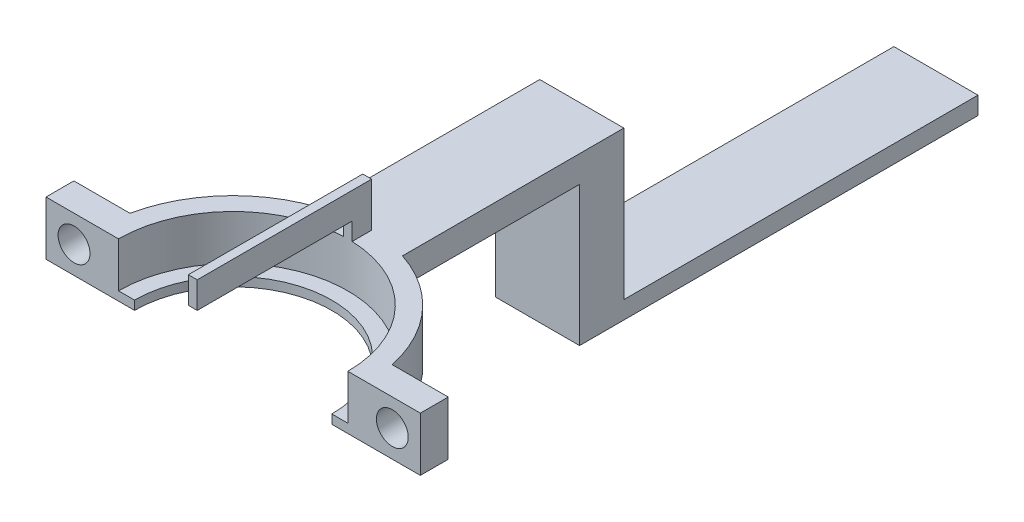
ISO-10303-21;
HEADER;
FILE_DESCRIPTION(('STEP AP214'),'2;1');
FILE_NAME('part.step','',(''),(''),'','','');
FILE_SCHEMA(('AUTOMOTIVE_DESIGN { 1 0 10303 214 1 1 1 1 }'));
ENDSEC;
DATA;
#1=APPLICATION_CONTEXT('core data for automotive mechanical design processes');
#2=APPLICATION_PROTOCOL_DEFINITION('international standard','automotive_design',2000,#1);
#3=PRODUCT_CONTEXT('',#1,'mechanical');
#4=PRODUCT('Part','Part','',(#3));
#5=PRODUCT_RELATED_PRODUCT_CATEGORY('part','',(#4));
#6=PRODUCT_DEFINITION_FORMATION('','',#4);
#7=PRODUCT_DEFINITION_CONTEXT('part definition',#1,'design');
#8=PRODUCT_DEFINITION('design','',#6,#7);
#9=PRODUCT_DEFINITION_SHAPE('','',#8);
#10=(LENGTH_UNIT() NAMED_UNIT(*) SI_UNIT(.MILLI.,.METRE.));
#11=(NAMED_UNIT(*) PLANE_ANGLE_UNIT() SI_UNIT($,.RADIAN.));
#12=(NAMED_UNIT(*) SI_UNIT($,.STERADIAN.) SOLID_ANGLE_UNIT());
#13=UNCERTAINTY_MEASURE_WITH_UNIT(LENGTH_MEASURE(1.E-05),#10,'distance_accuracy_value','');
#14=(GEOMETRIC_REPRESENTATION_CONTEXT(3) GLOBAL_UNCERTAINTY_ASSIGNED_CONTEXT((#13)) GLOBAL_UNIT_ASSIGNED_CONTEXT((#10,
#11,#12)) REPRESENTATION_CONTEXT('',''));
#15=CARTESIAN_POINT('',(0.,0.,0.));
#16=DIRECTION('',(0.,0.,1.));
#17=DIRECTION('',(1.,0.,0.));
#18=AXIS2_PLACEMENT_3D('',#15,#16,#17);
#19=CARTESIAN_POINT('',(-49.7442644411717,8.73372881640382,0.));
#20=DIRECTION('',(0.,1.,0.));
#21=DIRECTION('',(0.,0.,1.));
#22=AXIS2_PLACEMENT_3D('',#19,#20,#21);
#23=PLANE('',#22);
#24=DIRECTION('',(-1.,0.,0.));
#25=VECTOR('',#24,1.);
#26=CARTESIAN_POINT('',(-54.4942644411717,8.73372881640382,-34.3758545480795));
#27=LINE('',#26,#25);
#28=CARTESIAN_POINT('',(-44.9942644411717,8.73372881640382,-34.3758545480795));
#29=VERTEX_POINT('',#28);
#30=CARTESIAN_POINT('',(-54.4942644411717,8.73372881640382,-34.3758545480795));
#31=VERTEX_POINT('',#30);
#32=EDGE_CURVE('E279',#29,#31,#27,.T.);
#33=ORIENTED_EDGE('',*,*,#32,.F.);
#34=DIRECTION('',(0.,0.,-1.));
#35=VECTOR('',#34,1.);
#36=CARTESIAN_POINT('',(-44.9942644411717,8.73372881640382,-39.3758545480795));
#37=LINE('',#36,#35);
#38=CARTESIAN_POINT('',(-44.9942644411717,8.73372881640382,-14.3758545480795));
#39=VERTEX_POINT('',#38);
#40=EDGE_CURVE('E304',#39,#29,#37,.T.);
#41=ORIENTED_EDGE('',*,*,#40,.F.);
#42=CARTESIAN_POINT('',(-49.7442644411717,8.73372881640382,0.));
#43=DIRECTION('',(0.,-1.,0.));
#44=DIRECTION('',(0.,0.,1.));
#45=AXIS2_PLACEMENT_3D('',#42,#43,#44);
#46=CIRCLE('',#45,15.1402673023807);
#47=CARTESIAN_POINT('',(-54.4942644411717,8.73372881640382,-14.3758545480795));
#48=VERTEX_POINT('',#47);
#49=EDGE_CURVE('E301',#48,#39,#46,.T.);
#50=ORIENTED_EDGE('',*,*,#49,.F.);
#51=DIRECTION('',(0.,0.,1.));
#52=VECTOR('',#51,1.);
#53=CARTESIAN_POINT('',(-54.4942644411717,8.73372881640382,-14.3758545480795));
#54=LINE('',#53,#52);
#55=EDGE_CURVE('E309',#31,#48,#54,.T.);
#56=ORIENTED_EDGE('',*,*,#55,.F.);
#57=EDGE_LOOP('',(#33,#41,#50,#56));
#58=FACE_BOUND('',#57,.T.);
#59=ADVANCED_FACE('F45',(#58),#23,.F.);
#60=CARTESIAN_POINT('',(-49.7442644411717,0.,0.));
#61=DIRECTION('',(0.,-1.,0.));
#62=DIRECTION('',(0.,0.,-1.));
#63=AXIS2_PLACEMENT_3D('',#60,#61,#62);
#64=CYLINDRICAL_SURFACE('',#63,15.1402673023807);
#65=CARTESIAN_POINT('',(-49.7442644411717,5.63979924945554,0.));
#66=DIRECTION('',(0.,-1.,0.));
#67=DIRECTION('',(0.,0.,-1.));
#68=AXIS2_PLACEMENT_3D('',#65,#66,#67);
#69=CIRCLE('',#68,15.1402673023807);
#70=CARTESIAN_POINT('',(-64.5532209873817,5.63979924945554,-3.15));
#71=VERTEX_POINT('',#70);
#72=CARTESIAN_POINT('',(-34.9353078949616,5.63979924945554,-3.15000000000001));
#73=VERTEX_POINT('',#72);
#74=EDGE_CURVE('E412',#71,#73,#69,.T.);
#75=ORIENTED_EDGE('',*,*,#74,.F.);
#76=DIRECTION('',(0.,1.,0.));
#77=VECTOR('',#76,1.);
#78=CARTESIAN_POINT('',(-64.5532209873817,-3.29191368207121,-3.15));
#79=LINE('',#78,#77);
#80=CARTESIAN_POINT('',(-64.5532209873817,11.7337288164038,-3.15));
#81=VERTEX_POINT('',#80);
#82=EDGE_CURVE('E425',#71,#81,#79,.T.);
#83=ORIENTED_EDGE('',*,*,#82,.T.);
#84=CARTESIAN_POINT('',(-49.7442644411717,11.7337288164038,0.));
#85=DIRECTION('',(0.,-1.,0.));
#86=DIRECTION('',(0.,0.,-1.));
#87=AXIS2_PLACEMENT_3D('',#84,#85,#86);
#88=CIRCLE('',#87,15.1402673023807);
#89=CARTESIAN_POINT('',(-54.4942644411717,11.7337288164038,-14.3758545480795));
#90=VERTEX_POINT('',#89);
#91=EDGE_CURVE('E55',#81,#90,#88,.T.);
#92=ORIENTED_EDGE('',*,*,#91,.T.);
#93=DIRECTION('',(0.,1.,0.));
#94=VECTOR('',#93,1.);
#95=CARTESIAN_POINT('',(-54.4942644411717,8.73372881640382,-14.3758545480795));
#96=LINE('',#95,#94);
#97=EDGE_CURVE('E327',#48,#90,#96,.T.);
#98=ORIENTED_EDGE('',*,*,#97,.F.);
#99=ORIENTED_EDGE('',*,*,#49,.T.);
#100=DIRECTION('',(0.,1.,0.));
#101=VECTOR('',#100,1.);
#102=CARTESIAN_POINT('',(-44.9942644411717,8.73372881640382,-14.3758545480795));
#103=LINE('',#102,#101);
#104=CARTESIAN_POINT('',(-44.9942644411717,11.7337288164038,-14.3758545480795));
#105=VERTEX_POINT('',#104);
#106=EDGE_CURVE('E312',#39,#105,#103,.T.);
#107=ORIENTED_EDGE('',*,*,#106,.T.);
#108=CARTESIAN_POINT('',(-34.9353078949616,11.7337288164038,-3.15000000000001));
#109=VERTEX_POINT('',#108);
#110=EDGE_CURVE('E11',#105,#109,#88,.T.);
#111=ORIENTED_EDGE('',*,*,#110,.T.);
#112=DIRECTION('',(0.,1.,0.));
#113=VECTOR('',#112,1.);
#114=CARTESIAN_POINT('',(-34.9353078949616,-3.29191368207121,-3.15000000000001));
#115=LINE('',#114,#113);
#116=EDGE_CURVE('E251',#73,#109,#115,.T.);
#117=ORIENTED_EDGE('',*,*,#116,.F.);
#118=EDGE_LOOP('',(#75,#83,#92,#98,#99,#107,#111,#117));
#119=FACE_BOUND('',#118,.T.);
#120=ADVANCED_FACE('F423',(#119),#64,.T.);
#121=CARTESIAN_POINT('',(-49.7442644411717,0.,0.));
#122=DIRECTION('',(0.,-1.,0.));
#123=DIRECTION('',(0.,0.,-1.));
#124=AXIS2_PLACEMENT_3D('',#121,#122,#123);
#125=CYLINDRICAL_SURFACE('',#124,12.95);
#126=CARTESIAN_POINT('',(-49.7442644411717,6.65067910325642,0.));
#127=DIRECTION('',(0.,-1.,0.));
#128=DIRECTION('',(0.,0.,-1.));
#129=AXIS2_PLACEMENT_3D('',#126,#127,#128);
#130=CIRCLE('',#129,12.95);
#131=CARTESIAN_POINT('',(-62.6942644411717,6.65067910325642,0.));
#132=VERTEX_POINT('',#131);
#133=CARTESIAN_POINT('',(-36.7942644411717,6.65067910325642,0.));
#134=VERTEX_POINT('',#133);
#135=EDGE_CURVE('E400',#132,#134,#130,.T.);
#136=ORIENTED_EDGE('',*,*,#135,.T.);
#137=DIRECTION('',(0.,-1.,0.));
#138=VECTOR('',#137,1.);
#139=CARTESIAN_POINT('',(-36.7942644411717,0.,0.));
#140=LINE('',#139,#138);
#141=CARTESIAN_POINT('',(-36.7942644411717,11.7337288164038,0.));
#142=VERTEX_POINT('',#141);
#143=EDGE_CURVE('E481',#134,#142,#140,.F.);
#144=ORIENTED_EDGE('',*,*,#143,.T.);
#145=CARTESIAN_POINT('',(-49.7442644411717,11.7337288164038,0.));
#146=DIRECTION('',(0.,-1.,0.));
#147=DIRECTION('',(0.,0.,-1.));
#148=AXIS2_PLACEMENT_3D('',#145,#146,#147);
#149=CIRCLE('',#148,12.95);
#150=CARTESIAN_POINT('',(-49.2442644411717,11.7337288164038,-12.94034389033));
#151=VERTEX_POINT('',#150);
#152=EDGE_CURVE('E225',#151,#142,#149,.T.);
#153=ORIENTED_EDGE('',*,*,#152,.F.);
#154=DIRECTION('',(0.,-1.,0.));
#155=VECTOR('',#154,1.);
#156=CARTESIAN_POINT('',(-49.2442644411717,16.7337288164038,-12.94034389033));
#157=LINE('',#156,#155);
#158=CARTESIAN_POINT('',(-49.2442644411717,13.7337288164038,-12.94034389033));
#159=VERTEX_POINT('',#158);
#160=EDGE_CURVE('E386',#159,#151,#157,.T.);
#161=ORIENTED_EDGE('',*,*,#160,.F.);
#162=CARTESIAN_POINT('',(-49.7442644411717,13.7337288164038,0.));
#163=DIRECTION('',(0.,1.,0.));
#164=DIRECTION('',(0.,0.,1.));
#165=AXIS2_PLACEMENT_3D('',#162,#163,#164);
#166=CIRCLE('',#165,12.95);
#167=CARTESIAN_POINT('',(-50.2442644411717,13.7337288164038,-12.94034389033));
#168=VERTEX_POINT('',#167);
#169=EDGE_CURVE('E359',#168,#159,#166,.F.);
#170=ORIENTED_EDGE('',*,*,#169,.F.);
#171=DIRECTION('',(0.,-1.,0.));
#172=VECTOR('',#171,1.);
#173=CARTESIAN_POINT('',(-50.2442644411717,16.7337288164038,-12.94034389033));
#174=LINE('',#173,#172);
#175=CARTESIAN_POINT('',(-50.2442644411717,11.7337288164038,-12.94034389033));
#176=VERTEX_POINT('',#175);
#177=EDGE_CURVE('E389',#168,#176,#174,.T.);
#178=ORIENTED_EDGE('',*,*,#177,.T.);
#179=CARTESIAN_POINT('',(-62.6942644411717,11.7337288164038,0.));
#180=VERTEX_POINT('',#179);
#181=EDGE_CURVE('E397',#180,#176,#149,.T.);
#182=ORIENTED_EDGE('',*,*,#181,.F.);
#183=DIRECTION('',(0.,-1.,0.));
#184=VECTOR('',#183,1.);
#185=CARTESIAN_POINT('',(-62.6942644411717,0.,0.));
#186=LINE('',#185,#184);
#187=EDGE_CURVE('E215',#180,#132,#186,.T.);
#188=ORIENTED_EDGE('',*,*,#187,.T.);
#189=EDGE_LOOP('',(#136,#144,#153,#161,#170,#178,#182,#188));
#190=FACE_BOUND('',#189,.T.);
#191=ADVANCED_FACE('F524',(#190),#125,.F.);
#192=CARTESIAN_POINT('',(-62.6942644411717,11.7337288164038,0.));
#193=DIRECTION('',(0.,-1.,0.));
#194=DIRECTION('',(0.,0.,-1.));
#195=AXIS2_PLACEMENT_3D('',#192,#193,#194);
#196=PLANE('',#195);
#197=DIRECTION('',(0.,0.,1.));
#198=VECTOR('',#197,1.);
#199=CARTESIAN_POINT('',(-70.8845317435524,11.7337288164038,-3.15));
#200=LINE('',#199,#198);
#201=CARTESIAN_POINT('',(-70.8845317435524,11.7337288164038,-3.15));
#202=VERTEX_POINT('',#201);
#203=CARTESIAN_POINT('',(-70.8845317435524,11.7337288164038,0.));
#204=VERTEX_POINT('',#203);
#205=EDGE_CURVE('E239',#202,#204,#200,.T.);
#206=ORIENTED_EDGE('',*,*,#205,.T.);
#207=DIRECTION('',(-1.,0.,0.));
#208=VECTOR('',#207,1.);
#209=CARTESIAN_POINT('',(-23.4421170692061,11.7337288164038,0.));
#210=LINE('',#209,#208);
#211=EDGE_CURVE('E70',#180,#204,#210,.T.);
#212=ORIENTED_EDGE('',*,*,#211,.F.);
#213=ORIENTED_EDGE('',*,*,#181,.T.);
#214=DIRECTION('',(0.,0.,1.));
#215=VECTOR('',#214,1.);
#216=CARTESIAN_POINT('',(-50.2442644411717,11.7337288164038,-15.1320089210765));
#217=LINE('',#216,#215);
#218=CARTESIAN_POINT('',(-50.2442644411717,11.7337288164038,-15.1320089210765));
#219=VERTEX_POINT('',#218);
#220=EDGE_CURVE('E365',#219,#176,#217,.T.);
#221=ORIENTED_EDGE('',*,*,#220,.F.);
#222=CARTESIAN_POINT('',(-49.7442644411717,11.7337288164038,0.));
#223=DIRECTION('',(0.,-1.,0.));
#224=DIRECTION('',(0.,0.,1.));
#225=AXIS2_PLACEMENT_3D('',#222,#223,#224);
#226=CIRCLE('',#225,15.1402673023807);
#227=CARTESIAN_POINT('',(-49.2442644411717,11.7337288164038,-15.1320089210765));
#228=VERTEX_POINT('',#227);
#229=EDGE_CURVE('E305',#219,#228,#226,.T.);
#230=ORIENTED_EDGE('',*,*,#229,.T.);
#231=DIRECTION('',(0.,0.,-1.));
#232=VECTOR('',#231,1.);
#233=CARTESIAN_POINT('',(-49.2442644411717,11.7337288164038,-15.1320089210765));
#234=LINE('',#233,#232);
#235=EDGE_CURVE('E371',#151,#228,#234,.T.);
#236=ORIENTED_EDGE('',*,*,#235,.F.);
#237=ORIENTED_EDGE('',*,*,#152,.T.);
#238=CARTESIAN_POINT('',(-28.603997138791,11.7337288164038,0.));
#239=VERTEX_POINT('',#238);
#240=EDGE_CURVE('E208',#239,#142,#210,.T.);
#241=ORIENTED_EDGE('',*,*,#240,.F.);
#242=DIRECTION('',(0.,0.,-1.));
#243=VECTOR('',#242,1.);
#244=CARTESIAN_POINT('',(-28.603997138791,11.7337288164038,3.15000000000001));
#245=LINE('',#244,#243);
#246=CARTESIAN_POINT('',(-28.603997138791,11.7337288164038,-3.15000000000001));
#247=VERTEX_POINT('',#246);
#248=EDGE_CURVE('E221',#239,#247,#245,.T.);
#249=ORIENTED_EDGE('',*,*,#248,.T.);
#250=DIRECTION('',(-1.,0.,0.));
#251=VECTOR('',#250,1.);
#252=CARTESIAN_POINT('',(-28.603997138791,11.7337288164038,-3.15000000000001));
#253=LINE('',#252,#251);
#254=EDGE_CURVE('E234',#247,#109,#253,.T.);
#255=ORIENTED_EDGE('',*,*,#254,.T.);
#256=ORIENTED_EDGE('',*,*,#110,.F.);
#257=DIRECTION('',(0.,0.,-1.));
#258=VECTOR('',#257,1.);
#259=CARTESIAN_POINT('',(-44.9942644411717,11.7337288164038,-39.3758545480795));
#260=LINE('',#259,#258);
#261=CARTESIAN_POINT('',(-44.9942644411717,11.7337288164038,-39.3758545480795));
#262=VERTEX_POINT('',#261);
#263=EDGE_CURVE('E300',#105,#262,#260,.T.);
#264=ORIENTED_EDGE('',*,*,#263,.T.);
#265=DIRECTION('',(-1.,0.,0.));
#266=VECTOR('',#265,1.);
#267=CARTESIAN_POINT('',(-54.4942644411717,11.7337288164038,-39.3758545480795));
#268=LINE('',#267,#266);
#269=CARTESIAN_POINT('',(-54.4942644411717,11.7337288164038,-39.3758545480795));
#270=VERTEX_POINT('',#269);
#271=EDGE_CURVE('E316',#262,#270,#268,.T.);
#272=ORIENTED_EDGE('',*,*,#271,.T.);
#273=DIRECTION('',(0.,0.,1.));
#274=VECTOR('',#273,1.);
#275=CARTESIAN_POINT('',(-54.4942644411717,11.7337288164038,-14.3758545480795));
#276=LINE('',#275,#274);
#277=EDGE_CURVE('E320',#270,#90,#276,.T.);
#278=ORIENTED_EDGE('',*,*,#277,.T.);
#279=ORIENTED_EDGE('',*,*,#91,.F.);
#280=DIRECTION('',(-1.,0.,0.));
#281=VECTOR('',#280,1.);
#282=CARTESIAN_POINT('',(-64.5532209873817,11.7337288164038,-3.15));
#283=LINE('',#282,#281);
#284=EDGE_CURVE('E233',#81,#202,#283,.T.);
#285=ORIENTED_EDGE('',*,*,#284,.T.);
#286=EDGE_LOOP('',(#206,#212,#213,#221,#230,#236,#237,#241,#249,#255,#256,#264,#272,#278,#279,#285));
#287=FACE_BOUND('',#286,.T.);
#288=ADVANCED_FACE('F47',(#287),#196,.F.);
#289=DIRECTION('',(0.,-1.,0.));
#290=VECTOR('',#289,1.);
#291=CARTESIAN_POINT('',(-49.2442644411717,16.7337288164038,-15.1320089210765));
#292=LINE('',#291,#290);
#293=CARTESIAN_POINT('',(-49.2442644411717,16.7337288164038,-15.1320089210765));
#294=VERTEX_POINT('',#293);
#295=EDGE_CURVE('E377',#294,#228,#292,.T.);
#296=ORIENTED_EDGE('',*,*,#295,.T.);
#297=ORIENTED_EDGE('',*,*,#229,.F.);
#298=DIRECTION('',(0.,-1.,0.));
#299=VECTOR('',#298,1.);
#300=CARTESIAN_POINT('',(-50.2442644411717,16.7337288164038,-15.1320089210765));
#301=LINE('',#300,#299);
#302=CARTESIAN_POINT('',(-50.2442644411717,16.7337288164038,-15.1320089210765));
#303=VERTEX_POINT('',#302);
#304=EDGE_CURVE('E393',#303,#219,#301,.T.);
#305=ORIENTED_EDGE('',*,*,#304,.F.);
#306=CARTESIAN_POINT('',(-49.7442644411717,16.7337288164038,0.));
#307=DIRECTION('',(0.,1.,0.));
#308=DIRECTION('',(0.,0.,1.));
#309=AXIS2_PLACEMENT_3D('',#306,#307,#308);
#310=CIRCLE('',#309,15.1402673023807);
#311=EDGE_CURVE('E366',#294,#303,#310,.T.);
#312=ORIENTED_EDGE('',*,*,#311,.F.);
#313=EDGE_LOOP('',(#296,#297,#305,#312));
#314=FACE_BOUND('',#313,.T.);
#315=ADVANCED_FACE('F545',(#314),#64,.T.);
#316=CARTESIAN_POINT('',(-64.8845317435524,5.63979924945554,0.));
#317=DIRECTION('',(0.,1.,0.));
#318=DIRECTION('',(0.,0.,1.));
#319=AXIS2_PLACEMENT_3D('',#316,#317,#318);
#320=PLANE('',#319);
#321=DIRECTION('',(0.,0.,1.));
#322=VECTOR('',#321,1.);
#323=CARTESIAN_POINT('',(-28.603997138791,5.63979924945554,3.15000000000001));
#324=LINE('',#323,#322);
#325=CARTESIAN_POINT('',(-28.603997138791,5.63979924945554,-3.15000000000001));
#326=VERTEX_POINT('',#325);
#327=CARTESIAN_POINT('',(-28.603997138791,5.63979924945554,0.));
#328=VERTEX_POINT('',#327);
#329=EDGE_CURVE('E247',#326,#328,#324,.T.);
#330=ORIENTED_EDGE('',*,*,#329,.T.);
#331=DIRECTION('',(-1.,0.,0.));
#332=VECTOR('',#331,1.);
#333=CARTESIAN_POINT('',(-64.8845317435524,5.63979924945554,0.));
#334=LINE('',#333,#332);
#335=CARTESIAN_POINT('',(-38.603997138791,5.63979924945554,0.));
#336=VERTEX_POINT('',#335);
#337=EDGE_CURVE('E62',#328,#336,#334,.T.);
#338=ORIENTED_EDGE('',*,*,#337,.T.);
#339=CARTESIAN_POINT('',(-49.7442644411717,5.63979924945554,0.));
#340=DIRECTION('',(0.,-1.,0.));
#341=DIRECTION('',(0.,0.,-1.));
#342=AXIS2_PLACEMENT_3D('',#339,#340,#341);
#343=CIRCLE('',#342,11.1402673023807);
#344=CARTESIAN_POINT('',(-60.8845317435524,5.63979924945554,0.));
#345=VERTEX_POINT('',#344);
#346=EDGE_CURVE('E408',#345,#336,#343,.T.);
#347=ORIENTED_EDGE('',*,*,#346,.F.);
#348=CARTESIAN_POINT('',(-70.8845317435524,5.63979924945554,0.));
#349=VERTEX_POINT('',#348);
#350=EDGE_CURVE('E503',#345,#349,#334,.T.);
#351=ORIENTED_EDGE('',*,*,#350,.T.);
#352=DIRECTION('',(0.,0.,-1.));
#353=VECTOR('',#352,1.);
#354=CARTESIAN_POINT('',(-70.8845317435524,5.63979924945554,-3.15));
#355=LINE('',#354,#353);
#356=CARTESIAN_POINT('',(-70.8845317435524,5.63979924945554,-3.15));
#357=VERTEX_POINT('',#356);
#358=EDGE_CURVE('E467',#349,#357,#355,.T.);
#359=ORIENTED_EDGE('',*,*,#358,.T.);
#360=DIRECTION('',(1.,0.,0.));
#361=VECTOR('',#360,1.);
#362=CARTESIAN_POINT('',(-64.5532209873817,5.63979924945554,-3.15));
#363=LINE('',#362,#361);
#364=EDGE_CURVE('E271',#357,#71,#363,.T.);
#365=ORIENTED_EDGE('',*,*,#364,.T.);
#366=ORIENTED_EDGE('',*,*,#74,.T.);
#367=DIRECTION('',(1.,0.,0.));
#368=VECTOR('',#367,1.);
#369=CARTESIAN_POINT('',(-28.603997138791,5.63979924945554,-3.15000000000001));
#370=LINE('',#369,#368);
#371=EDGE_CURVE('E244',#73,#326,#370,.T.);
#372=ORIENTED_EDGE('',*,*,#371,.T.);
#373=EDGE_LOOP('',(#330,#338,#347,#351,#359,#365,#366,#372));
#374=FACE_BOUND('',#373,.T.);
#375=ADVANCED_FACE('F534',(#374),#320,.F.);
#376=CARTESIAN_POINT('',(-49.7442644411717,0.,0.));
#377=DIRECTION('',(0.,-1.,0.));
#378=DIRECTION('',(0.,0.,-1.));
#379=AXIS2_PLACEMENT_3D('',#376,#377,#378);
#380=CYLINDRICAL_SURFACE('',#379,11.1402673023807);
#381=ORIENTED_EDGE('',*,*,#346,.T.);
#382=DIRECTION('',(0.,-1.,0.));
#383=VECTOR('',#382,1.);
#384=CARTESIAN_POINT('',(-38.603997138791,0.,0.));
#385=LINE('',#384,#383);
#386=CARTESIAN_POINT('',(-38.603997138791,6.65067910325642,0.));
#387=VERTEX_POINT('',#386);
#388=EDGE_CURVE('E488',#336,#387,#385,.F.);
#389=ORIENTED_EDGE('',*,*,#388,.T.);
#390=CARTESIAN_POINT('',(-49.7442644411717,6.65067910325642,0.));
#391=DIRECTION('',(0.,-1.,0.));
#392=DIRECTION('',(0.,0.,-1.));
#393=AXIS2_PLACEMENT_3D('',#390,#391,#392);
#394=CIRCLE('',#393,11.1402673023807);
#395=CARTESIAN_POINT('',(-60.8845317435524,6.65067910325642,0.));
#396=VERTEX_POINT('',#395);
#397=EDGE_CURVE('E404',#396,#387,#394,.T.);
#398=ORIENTED_EDGE('',*,*,#397,.F.);
#399=DIRECTION('',(0.,-1.,0.));
#400=VECTOR('',#399,1.);
#401=CARTESIAN_POINT('',(-60.8845317435524,0.,0.));
#402=LINE('',#401,#400);
#403=EDGE_CURVE('E499',#396,#345,#402,.T.);
#404=ORIENTED_EDGE('',*,*,#403,.T.);
#405=EDGE_LOOP('',(#381,#389,#398,#404));
#406=FACE_BOUND('',#405,.T.);
#407=ADVANCED_FACE('F536',(#406),#380,.F.);
#408=CARTESIAN_POINT('',(-60.8845317435524,6.65067910325642,0.));
#409=DIRECTION('',(0.,-1.,0.));
#410=DIRECTION('',(0.,0.,-1.));
#411=AXIS2_PLACEMENT_3D('',#408,#409,#410);
#412=PLANE('',#411);
#413=ORIENTED_EDGE('',*,*,#135,.F.);
#414=DIRECTION('',(1.,0.,0.));
#415=VECTOR('',#414,1.);
#416=CARTESIAN_POINT('',(-60.8845317435524,6.65067910325642,0.));
#417=LINE('',#416,#415);
#418=EDGE_CURVE('E495',#132,#396,#417,.T.);
#419=ORIENTED_EDGE('',*,*,#418,.T.);
#420=ORIENTED_EDGE('',*,*,#397,.T.);
#421=EDGE_CURVE('E487',#387,#134,#417,.T.);
#422=ORIENTED_EDGE('',*,*,#421,.T.);
#423=EDGE_LOOP('',(#413,#419,#420,#422));
#424=FACE_BOUND('',#423,.T.);
#425=ADVANCED_FACE('F521',(#424),#412,.F.);
#426=CARTESIAN_POINT('',(-50.2442644411717,16.7337288164038,-15.1320089210765));
#427=DIRECTION('',(1.,0.,0.));
#428=DIRECTION('',(0.,0.,-1.));
#429=AXIS2_PLACEMENT_3D('',#426,#427,#428);
#430=PLANE('',#429);
#431=ORIENTED_EDGE('',*,*,#304,.T.);
#432=ORIENTED_EDGE('',*,*,#220,.T.);
#433=ORIENTED_EDGE('',*,*,#177,.F.);
#434=DIRECTION('',(0.,0.,1.));
#435=VECTOR('',#434,1.);
#436=CARTESIAN_POINT('',(-50.2442644411717,13.7337288164038,-15.1320089210765));
#437=LINE('',#436,#435);
#438=CARTESIAN_POINT('',(-50.2442644411717,13.7337288164038,4.55965610967004));
#439=VERTEX_POINT('',#438);
#440=EDGE_CURVE('E340',#168,#439,#437,.T.);
#441=ORIENTED_EDGE('',*,*,#440,.T.);
#442=DIRECTION('',(0.,1.,0.));
#443=VECTOR('',#442,1.);
#444=CARTESIAN_POINT('',(-50.2442644411717,13.7337288164038,4.55965610967004));
#445=LINE('',#444,#443);
#446=CARTESIAN_POINT('',(-50.2442644411717,16.7337288164038,4.55965610967004));
#447=VERTEX_POINT('',#446);
#448=EDGE_CURVE('E351',#439,#447,#445,.T.);
#449=ORIENTED_EDGE('',*,*,#448,.T.);
#450=DIRECTION('',(0.,0.,1.));
#451=VECTOR('',#450,1.);
#452=CARTESIAN_POINT('',(-50.2442644411717,16.7337288164038,-15.1320089210765));
#453=LINE('',#452,#451);
#454=EDGE_CURVE('E370',#303,#447,#453,.T.);
#455=ORIENTED_EDGE('',*,*,#454,.F.);
#456=EDGE_LOOP('',(#431,#432,#433,#441,#449,#455));
#457=FACE_BOUND('',#456,.T.);
#458=ADVANCED_FACE('F543',(#457),#430,.F.);
#459=CARTESIAN_POINT('',(-49.2442644411717,16.7337288164038,-15.1320089210765));
#460=DIRECTION('',(-1.,0.,0.));
#461=DIRECTION('',(0.,0.,1.));
#462=AXIS2_PLACEMENT_3D('',#459,#460,#461);
#463=PLANE('',#462);
#464=DIRECTION('',(0.,0.,-1.));
#465=VECTOR('',#464,1.);
#466=CARTESIAN_POINT('',(-49.2442644411717,16.7337288164038,-15.1320089210765));
#467=LINE('',#466,#465);
#468=CARTESIAN_POINT('',(-49.2442644411717,16.7337288164038,4.55965610967004));
#469=VERTEX_POINT('',#468);
#470=EDGE_CURVE('E374',#469,#294,#467,.T.);
#471=ORIENTED_EDGE('',*,*,#470,.F.);
#472=DIRECTION('',(0.,1.,0.));
#473=VECTOR('',#472,1.);
#474=CARTESIAN_POINT('',(-49.2442644411717,13.7337288164038,4.55965610967004));
#475=LINE('',#474,#473);
#476=CARTESIAN_POINT('',(-49.2442644411717,13.7337288164038,4.55965610967004));
#477=VERTEX_POINT('',#476);
#478=EDGE_CURVE('E355',#477,#469,#475,.T.);
#479=ORIENTED_EDGE('',*,*,#478,.F.);
#480=DIRECTION('',(0.,0.,-1.));
#481=VECTOR('',#480,1.);
#482=CARTESIAN_POINT('',(-49.2442644411717,13.7337288164038,4.55965610967004));
#483=LINE('',#482,#481);
#484=EDGE_CURVE('E347',#477,#159,#483,.T.);
#485=ORIENTED_EDGE('',*,*,#484,.T.);
#486=ORIENTED_EDGE('',*,*,#160,.T.);
#487=ORIENTED_EDGE('',*,*,#235,.T.);
#488=ORIENTED_EDGE('',*,*,#295,.F.);
#489=EDGE_LOOP('',(#471,#479,#485,#486,#487,#488));
#490=FACE_BOUND('',#489,.T.);
#491=ADVANCED_FACE('F574',(#490),#463,.F.);
#492=CARTESIAN_POINT('',(-49.7442644411717,16.7337288164038,0.));
#493=DIRECTION('',(0.,1.,0.));
#494=DIRECTION('',(0.,0.,1.));
#495=AXIS2_PLACEMENT_3D('',#492,#493,#494);
#496=PLANE('',#495);
#497=ORIENTED_EDGE('',*,*,#311,.T.);
#498=ORIENTED_EDGE('',*,*,#454,.T.);
#499=DIRECTION('',(1.,0.,0.));
#500=VECTOR('',#499,1.);
#501=CARTESIAN_POINT('',(-50.2442644411717,16.7337288164038,4.55965610967004));
#502=LINE('',#501,#500);
#503=EDGE_CURVE('E331',#447,#469,#502,.T.);
#504=ORIENTED_EDGE('',*,*,#503,.T.);
#505=ORIENTED_EDGE('',*,*,#470,.T.);
#506=EDGE_LOOP('',(#497,#498,#504,#505));
#507=FACE_BOUND('',#506,.T.);
#508=ADVANCED_FACE('F567',(#507),#496,.T.);
#509=CARTESIAN_POINT('',(-49.7442644411717,13.7337288164038,0.));
#510=DIRECTION('',(0.,1.,0.));
#511=DIRECTION('',(0.,0.,1.));
#512=AXIS2_PLACEMENT_3D('',#509,#510,#511);
#513=PLANE('',#512);
#514=ORIENTED_EDGE('',*,*,#440,.F.);
#515=ORIENTED_EDGE('',*,*,#169,.T.);
#516=ORIENTED_EDGE('',*,*,#484,.F.);
#517=DIRECTION('',(1.,0.,0.));
#518=VECTOR('',#517,1.);
#519=CARTESIAN_POINT('',(-50.2442644411717,13.7337288164038,4.55965610967004));
#520=LINE('',#519,#518);
#521=EDGE_CURVE('E343',#439,#477,#520,.T.);
#522=ORIENTED_EDGE('',*,*,#521,.F.);
#523=EDGE_LOOP('',(#514,#515,#516,#522));
#524=FACE_BOUND('',#523,.T.);
#525=ADVANCED_FACE('F564',(#524),#513,.F.);
#526=CARTESIAN_POINT('',(-50.2442644411717,13.7337288164038,4.55965610967004));
#527=DIRECTION('',(0.,0.,1.));
#528=DIRECTION('',(1.,0.,0.));
#529=AXIS2_PLACEMENT_3D('',#526,#527,#528);
#530=PLANE('',#529);
#531=ORIENTED_EDGE('',*,*,#503,.F.);
#532=ORIENTED_EDGE('',*,*,#448,.F.);
#533=ORIENTED_EDGE('',*,*,#521,.T.);
#534=ORIENTED_EDGE('',*,*,#478,.T.);
#535=EDGE_LOOP('',(#531,#532,#533,#534));
#536=FACE_BOUND('',#535,.T.);
#537=ADVANCED_FACE('F559',(#536),#530,.T.);
#538=CARTESIAN_POINT('',(-54.4942644411717,8.73372881640382,-14.3758545480795));
#539=DIRECTION('',(-1.,0.,0.));
#540=DIRECTION('',(0.,0.,1.));
#541=AXIS2_PLACEMENT_3D('',#538,#539,#540);
#542=PLANE('',#541);
#543=ORIENTED_EDGE('',*,*,#277,.F.);
#544=DIRECTION('',(0.,1.,0.));
#545=VECTOR('',#544,1.);
#546=CARTESIAN_POINT('',(-54.4942644411717,8.73372881640382,-39.3758545480795));
#547=LINE('',#546,#545);
#548=CARTESIAN_POINT('',(-54.4942644411717,-5.04627118359618,-39.3758545480795));
#549=VERTEX_POINT('',#548);
#550=EDGE_CURVE('E332',#549,#270,#547,.T.);
#551=ORIENTED_EDGE('',*,*,#550,.F.);
#552=DIRECTION('',(0.,0.,1.));
#553=VECTOR('',#552,1.);
#554=CARTESIAN_POINT('',(-54.4942644411717,-5.04627118359618,-79.3758545480795));
#555=LINE('',#554,#553);
#556=CARTESIAN_POINT('',(-54.4942644411717,-5.04627118359618,-79.3758545480795));
#557=VERTEX_POINT('',#556);
#558=EDGE_CURVE('E275',#557,#549,#555,.T.);
#559=ORIENTED_EDGE('',*,*,#558,.F.);
#560=DIRECTION('',(0.,1.,0.));
#561=VECTOR('',#560,1.);
#562=CARTESIAN_POINT('',(-54.4942644411717,-7.04627118359618,-79.3758545480795));
#563=LINE('',#562,#561);
#564=CARTESIAN_POINT('',(-54.4942644411717,-7.04627118359618,-79.3758545480795));
#565=VERTEX_POINT('',#564);
#566=EDGE_CURVE('E261',#565,#557,#563,.T.);
#567=ORIENTED_EDGE('',*,*,#566,.F.);
#568=DIRECTION('',(0.,0.,-1.));
#569=VECTOR('',#568,1.);
#570=CARTESIAN_POINT('',(-54.4942644411717,-7.04627118359618,-39.3758545480795));
#571=LINE('',#570,#569);
#572=CARTESIAN_POINT('',(-54.4942644411717,-7.04627118359618,-34.3758545480795));
#573=VERTEX_POINT('',#572);
#574=EDGE_CURVE('E280',#573,#565,#571,.T.);
#575=ORIENTED_EDGE('',*,*,#574,.F.);
#576=DIRECTION('',(0.,1.,0.));
#577=VECTOR('',#576,1.);
#578=CARTESIAN_POINT('',(-54.4942644411717,-7.04627118359618,-34.3758545480795));
#579=LINE('',#578,#577);
#580=EDGE_CURVE('E289',#573,#31,#579,.T.);
#581=ORIENTED_EDGE('',*,*,#580,.T.);
#582=ORIENTED_EDGE('',*,*,#55,.T.);
#583=ORIENTED_EDGE('',*,*,#97,.T.);
#584=EDGE_LOOP('',(#543,#551,#559,#567,#575,#581,#582,#583));
#585=FACE_BOUND('',#584,.T.);
#586=ADVANCED_FACE('F428',(#585),#542,.T.);
#587=CARTESIAN_POINT('',(-54.4942644411717,8.73372881640382,-39.3758545480795));
#588=DIRECTION('',(0.,0.,-1.));
#589=DIRECTION('',(-1.,0.,0.));
#590=AXIS2_PLACEMENT_3D('',#587,#588,#589);
#591=PLANE('',#590);
#592=DIRECTION('',(1.,0.,0.));
#593=VECTOR('',#592,1.);
#594=CARTESIAN_POINT('',(-44.9942644411717,-5.04627118359618,-39.3758545480795));
#595=LINE('',#594,#593);
#596=CARTESIAN_POINT('',(-44.9942644411717,-5.04627118359618,-39.3758545480795));
#597=VERTEX_POINT('',#596);
#598=EDGE_CURVE('E257',#549,#597,#595,.T.);
#599=ORIENTED_EDGE('',*,*,#598,.F.);
#600=ORIENTED_EDGE('',*,*,#550,.T.);
#601=ORIENTED_EDGE('',*,*,#271,.F.);
#602=DIRECTION('',(0.,1.,0.));
#603=VECTOR('',#602,1.);
#604=CARTESIAN_POINT('',(-44.9942644411717,8.73372881640382,-39.3758545480795));
#605=LINE('',#604,#603);
#606=EDGE_CURVE('E335',#597,#262,#605,.T.);
#607=ORIENTED_EDGE('',*,*,#606,.F.);
#608=EDGE_LOOP('',(#599,#600,#601,#607));
#609=FACE_BOUND('',#608,.T.);
#610=ADVANCED_FACE('F434',(#609),#591,.T.);
#611=CARTESIAN_POINT('',(-44.9942644411717,8.73372881640382,-39.3758545480795));
#612=DIRECTION('',(1.,0.,0.));
#613=DIRECTION('',(0.,0.,-1.));
#614=AXIS2_PLACEMENT_3D('',#611,#612,#613);
#615=PLANE('',#614);
#616=ORIENTED_EDGE('',*,*,#263,.F.);
#617=ORIENTED_EDGE('',*,*,#106,.F.);
#618=ORIENTED_EDGE('',*,*,#40,.T.);
#619=DIRECTION('',(0.,1.,0.));
#620=VECTOR('',#619,1.);
#621=CARTESIAN_POINT('',(-44.9942644411717,-7.04627118359618,-34.3758545480795));
#622=LINE('',#621,#620);
#623=CARTESIAN_POINT('',(-44.9942644411717,-7.04627118359618,-34.3758545480795));
#624=VERTEX_POINT('',#623);
#625=EDGE_CURVE('E296',#624,#29,#622,.T.);
#626=ORIENTED_EDGE('',*,*,#625,.F.);
#627=DIRECTION('',(0.,0.,1.));
#628=VECTOR('',#627,1.);
#629=CARTESIAN_POINT('',(-44.9942644411717,-7.04627118359618,-39.3758545480795));
#630=LINE('',#629,#628);
#631=CARTESIAN_POINT('',(-44.9942644411717,-7.04627118359618,-79.3758545480795));
#632=VERTEX_POINT('',#631);
#633=EDGE_CURVE('E283',#632,#624,#630,.T.);
#634=ORIENTED_EDGE('',*,*,#633,.F.);
#635=DIRECTION('',(0.,-1.,0.));
#636=VECTOR('',#635,1.);
#637=CARTESIAN_POINT('',(-44.9942644411717,-7.04627118359618,-79.3758545480795));
#638=LINE('',#637,#636);
#639=CARTESIAN_POINT('',(-44.9942644411717,-5.04627118359618,-79.3758545480795));
#640=VERTEX_POINT('',#639);
#641=EDGE_CURVE('E252',#640,#632,#638,.T.);
#642=ORIENTED_EDGE('',*,*,#641,.F.);
#643=DIRECTION('',(0.,0.,1.));
#644=VECTOR('',#643,1.);
#645=CARTESIAN_POINT('',(-44.9942644411717,-5.04627118359618,-79.3758545480795));
#646=LINE('',#645,#644);
#647=EDGE_CURVE('E267',#640,#597,#646,.T.);
#648=ORIENTED_EDGE('',*,*,#647,.T.);
#649=ORIENTED_EDGE('',*,*,#606,.T.);
#650=EDGE_LOOP('',(#616,#617,#618,#626,#634,#642,#648,#649));
#651=FACE_BOUND('',#650,.T.);
#652=ADVANCED_FACE('F457',(#651),#615,.T.);
#653=CARTESIAN_POINT('',(-54.4942644411717,-7.04627118359618,-34.3758545480795));
#654=DIRECTION('',(0.,0.,-1.));
#655=DIRECTION('',(-1.,0.,0.));
#656=AXIS2_PLACEMENT_3D('',#653,#654,#655);
#657=PLANE('',#656);
#658=ORIENTED_EDGE('',*,*,#32,.T.);
#659=ORIENTED_EDGE('',*,*,#580,.F.);
#660=DIRECTION('',(-1.,0.,0.));
#661=VECTOR('',#660,1.);
#662=CARTESIAN_POINT('',(-54.4942644411717,-7.04627118359618,-34.3758545480795));
#663=LINE('',#662,#661);
#664=EDGE_CURVE('E286',#624,#573,#663,.T.);
#665=ORIENTED_EDGE('',*,*,#664,.F.);
#666=ORIENTED_EDGE('',*,*,#625,.T.);
#667=EDGE_LOOP('',(#658,#659,#665,#666));
#668=FACE_BOUND('',#667,.T.);
#669=ADVANCED_FACE('F452',(#668),#657,.F.);
#670=CARTESIAN_POINT('',(0.,-7.04627118359618,0.));
#671=DIRECTION('',(0.,1.,0.));
#672=DIRECTION('',(0.,0.,1.));
#673=AXIS2_PLACEMENT_3D('',#670,#671,#672);
#674=PLANE('',#673);
#675=ORIENTED_EDGE('',*,*,#574,.T.);
#676=DIRECTION('',(-1.,0.,0.));
#677=VECTOR('',#676,1.);
#678=CARTESIAN_POINT('',(-44.9942644411717,-7.04627118359618,-79.3758545480795));
#679=LINE('',#678,#677);
#680=EDGE_CURVE('E256',#632,#565,#679,.T.);
#681=ORIENTED_EDGE('',*,*,#680,.F.);
#682=ORIENTED_EDGE('',*,*,#633,.T.);
#683=ORIENTED_EDGE('',*,*,#664,.T.);
#684=EDGE_LOOP('',(#675,#681,#682,#683));
#685=FACE_BOUND('',#684,.T.);
#686=ADVANCED_FACE('F448',(#685),#674,.F.);
#687=CARTESIAN_POINT('',(-44.9942644411717,-5.04627118359618,-79.3758545480795));
#688=DIRECTION('',(0.,-1.,0.));
#689=DIRECTION('',(0.,0.,-1.));
#690=AXIS2_PLACEMENT_3D('',#687,#688,#689);
#691=PLANE('',#690);
#692=ORIENTED_EDGE('',*,*,#598,.T.);
#693=ORIENTED_EDGE('',*,*,#647,.F.);
#694=DIRECTION('',(1.,0.,0.));
#695=VECTOR('',#694,1.);
#696=CARTESIAN_POINT('',(-44.9942644411717,-5.04627118359618,-79.3758545480795));
#697=LINE('',#696,#695);
#698=EDGE_CURVE('E264',#557,#640,#697,.T.);
#699=ORIENTED_EDGE('',*,*,#698,.F.);
#700=ORIENTED_EDGE('',*,*,#558,.T.);
#701=EDGE_LOOP('',(#692,#693,#699,#700));
#702=FACE_BOUND('',#701,.T.);
#703=ADVANCED_FACE('F439',(#702),#691,.F.);
#704=CARTESIAN_POINT('',(0.,0.,-79.3758545480795));
#705=DIRECTION('',(0.,0.,1.));
#706=DIRECTION('',(1.,0.,0.));
#707=AXIS2_PLACEMENT_3D('',#704,#705,#706);
#708=PLANE('',#707);
#709=ORIENTED_EDGE('',*,*,#641,.T.);
#710=ORIENTED_EDGE('',*,*,#680,.T.);
#711=ORIENTED_EDGE('',*,*,#566,.T.);
#712=ORIENTED_EDGE('',*,*,#698,.T.);
#713=EDGE_LOOP('',(#709,#710,#711,#712));
#714=FACE_BOUND('',#713,.T.);
#715=ADVANCED_FACE('F443',(#714),#708,.F.);
#716=CARTESIAN_POINT('',(-28.603997138791,-3.29191368207121,-3.15000000000001));
#717=DIRECTION('',(0.,0.,-1.));
#718=DIRECTION('',(-1.,0.,0.));
#719=AXIS2_PLACEMENT_3D('',#716,#717,#718);
#720=PLANE('',#719);
#721=CARTESIAN_POINT('',(-31.7696525168763,8.68676403292968,-3.15000000000001));
#722=DIRECTION('',(0.,0.,-1.));
#723=DIRECTION('',(-1.,0.,0.));
#724=AXIS2_PLACEMENT_3D('',#721,#722,#723);
#725=CIRCLE('',#724,1.8);
#726=CARTESIAN_POINT('',(-33.5696525168763,8.68676403292968,-3.15000000000001));
#727=VERTEX_POINT('',#726);
#728=EDGE_CURVE('E477',#727,#727,#725,.F.);
#729=ORIENTED_EDGE('',*,*,#728,.T.);
#730=EDGE_LOOP('',(#729));
#731=FACE_BOUND('',#730,.T.);
#732=ORIENTED_EDGE('',*,*,#371,.F.);
#733=ORIENTED_EDGE('',*,*,#116,.T.);
#734=ORIENTED_EDGE('',*,*,#254,.F.);
#735=DIRECTION('',(0.,1.,0.));
#736=VECTOR('',#735,1.);
#737=CARTESIAN_POINT('',(-28.603997138791,-3.29191368207121,-3.15000000000001));
#738=LINE('',#737,#736);
#739=EDGE_CURVE('E230',#326,#247,#738,.T.);
#740=ORIENTED_EDGE('',*,*,#739,.F.);
#741=EDGE_LOOP('',(#732,#733,#734,#740));
#742=FACE_BOUND('',#741,.T.);
#743=ADVANCED_FACE('F460',(#731,#742),#720,.T.);
#744=CARTESIAN_POINT('',(-28.603997138791,-3.29191368207121,3.15000000000001));
#745=DIRECTION('',(1.,0.,0.));
#746=DIRECTION('',(0.,0.,-1.));
#747=AXIS2_PLACEMENT_3D('',#744,#745,#746);
#748=PLANE('',#747);
#749=DIRECTION('',(0.,1.,0.));
#750=VECTOR('',#749,1.);
#751=CARTESIAN_POINT('',(-28.603997138791,-3.29191368207121,0.));
#752=LINE('',#751,#750);
#753=EDGE_CURVE('E205',#328,#239,#752,.T.);
#754=ORIENTED_EDGE('',*,*,#753,.F.);
#755=ORIENTED_EDGE('',*,*,#329,.F.);
#756=ORIENTED_EDGE('',*,*,#739,.T.);
#757=ORIENTED_EDGE('',*,*,#248,.F.);
#758=EDGE_LOOP('',(#754,#755,#756,#757));
#759=FACE_BOUND('',#758,.T.);
#760=ADVANCED_FACE('F228',(#759),#748,.T.);
#761=CARTESIAN_POINT('',(-70.8845317435524,-3.29191368207121,-3.15));
#762=DIRECTION('',(-1.,0.,0.));
#763=DIRECTION('',(0.,0.,1.));
#764=AXIS2_PLACEMENT_3D('',#761,#762,#763);
#765=PLANE('',#764);
#766=DIRECTION('',(0.,-1.,0.));
#767=VECTOR('',#766,1.);
#768=CARTESIAN_POINT('',(-70.8845317435524,-3.29191368207121,0.));
#769=LINE('',#768,#767);
#770=EDGE_CURVE('E507',#204,#349,#769,.T.);
#771=ORIENTED_EDGE('',*,*,#770,.F.);
#772=ORIENTED_EDGE('',*,*,#205,.F.);
#773=DIRECTION('',(0.,1.,0.));
#774=VECTOR('',#773,1.);
#775=CARTESIAN_POINT('',(-70.8845317435524,-3.29191368207121,-3.15));
#776=LINE('',#775,#774);
#777=EDGE_CURVE('E470',#357,#202,#776,.T.);
#778=ORIENTED_EDGE('',*,*,#777,.F.);
#779=ORIENTED_EDGE('',*,*,#358,.F.);
#780=EDGE_LOOP('',(#771,#772,#778,#779));
#781=FACE_BOUND('',#780,.T.);
#782=ADVANCED_FACE('F530',(#781),#765,.T.);
#783=CARTESIAN_POINT('',(-64.5532209873817,-3.29191368207121,-3.15));
#784=DIRECTION('',(0.,0.,-1.));
#785=DIRECTION('',(-1.,0.,0.));
#786=AXIS2_PLACEMENT_3D('',#783,#784,#785);
#787=PLANE('',#786);
#788=CARTESIAN_POINT('',(-67.7188763654671,8.68676403292968,-3.15));
#789=DIRECTION('',(0.,0.,-1.));
#790=DIRECTION('',(-1.,0.,0.));
#791=AXIS2_PLACEMENT_3D('',#788,#789,#790);
#792=CIRCLE('',#791,1.79999999999999);
#793=CARTESIAN_POINT('',(-69.5188763654671,8.68676403292968,-3.15));
#794=VERTEX_POINT('',#793);
#795=EDGE_CURVE('E248',#794,#794,#792,.F.);
#796=ORIENTED_EDGE('',*,*,#795,.T.);
#797=EDGE_LOOP('',(#796));
#798=FACE_BOUND('',#797,.T.);
#799=ORIENTED_EDGE('',*,*,#364,.F.);
#800=ORIENTED_EDGE('',*,*,#777,.T.);
#801=ORIENTED_EDGE('',*,*,#284,.F.);
#802=ORIENTED_EDGE('',*,*,#82,.F.);
#803=EDGE_LOOP('',(#799,#800,#801,#802));
#804=FACE_BOUND('',#803,.T.);
#805=ADVANCED_FACE('F733',(#798,#804),#787,.T.);
#806=CARTESIAN_POINT('',(-67.7188763654671,8.68676403292968,-8.24116882454315));
#807=DIRECTION('',(0.,0.,1.));
#808=DIRECTION('',(1.,0.,0.));
#809=AXIS2_PLACEMENT_3D('',#806,#807,#808);
#810=CYLINDRICAL_SURFACE('',#809,1.79999999999999);
#811=CARTESIAN_POINT('',(-67.7188763654671,8.68676403292968,0.));
#812=DIRECTION('',(0.,0.,-1.));
#813=DIRECTION('',(-1.,0.,0.));
#814=AXIS2_PLACEMENT_3D('',#811,#812,#813);
#815=CIRCLE('',#814,1.79999999999999);
#816=CARTESIAN_POINT('',(-69.5188763654671,8.68676403292968,0.));
#817=VERTEX_POINT('',#816);
#818=EDGE_CURVE('E510',#817,#817,#815,.F.);
#819=ORIENTED_EDGE('',*,*,#818,.T.);
#820=EDGE_LOOP('',(#819));
#821=FACE_BOUND('',#820,.T.);
#822=ORIENTED_EDGE('',*,*,#795,.F.);
#823=EDGE_LOOP('',(#822));
#824=FACE_BOUND('',#823,.T.);
#825=ADVANCED_FACE('F740',(#821,#824),#810,.F.);
#826=CARTESIAN_POINT('',(-31.7696525168763,8.68676403292968,-8.24116882454315));
#827=DIRECTION('',(0.,0.,1.));
#828=DIRECTION('',(1.,0.,0.));
#829=AXIS2_PLACEMENT_3D('',#826,#827,#828);
#830=CYLINDRICAL_SURFACE('',#829,1.8);
#831=CARTESIAN_POINT('',(-31.7696525168763,8.68676403292968,0.));
#832=DIRECTION('',(0.,0.,-1.));
#833=DIRECTION('',(-1.,0.,0.));
#834=AXIS2_PLACEMENT_3D('',#831,#832,#833);
#835=CIRCLE('',#834,1.8);
#836=CARTESIAN_POINT('',(-33.5696525168763,8.68676403292968,0.));
#837=VERTEX_POINT('',#836);
#838=EDGE_CURVE('E49',#837,#837,#835,.F.);
#839=ORIENTED_EDGE('',*,*,#838,.T.);
#840=EDGE_LOOP('',(#839));
#841=FACE_BOUND('',#840,.T.);
#842=ORIENTED_EDGE('',*,*,#728,.F.);
#843=EDGE_LOOP('',(#842));
#844=FACE_BOUND('',#843,.T.);
#845=ADVANCED_FACE('F749',(#841,#844),#830,.F.);
#846=CARTESIAN_POINT('',(-23.4421170692061,-7.04627118359618,0.));
#847=DIRECTION('',(0.,0.,-1.));
#848=DIRECTION('',(-1.,0.,0.));
#849=AXIS2_PLACEMENT_3D('',#846,#847,#848);
#850=PLANE('',#849);
#851=ORIENTED_EDGE('',*,*,#838,.F.);
#852=EDGE_LOOP('',(#851));
#853=FACE_BOUND('',#852,.T.);
#854=ORIENTED_EDGE('',*,*,#421,.F.);
#855=ORIENTED_EDGE('',*,*,#388,.F.);
#856=ORIENTED_EDGE('',*,*,#337,.F.);
#857=ORIENTED_EDGE('',*,*,#753,.T.);
#858=ORIENTED_EDGE('',*,*,#240,.T.);
#859=ORIENTED_EDGE('',*,*,#143,.F.);
#860=EDGE_LOOP('',(#854,#855,#856,#857,#858,#859));
#861=FACE_BOUND('',#860,.T.);
#862=ADVANCED_FACE('F207',(#853,#861),#850,.F.);
#863=ORIENTED_EDGE('',*,*,#818,.F.);
#864=EDGE_LOOP('',(#863));
#865=FACE_BOUND('',#864,.T.);
#866=ORIENTED_EDGE('',*,*,#211,.T.);
#867=ORIENTED_EDGE('',*,*,#770,.T.);
#868=ORIENTED_EDGE('',*,*,#350,.F.);
#869=ORIENTED_EDGE('',*,*,#403,.F.);
#870=ORIENTED_EDGE('',*,*,#418,.F.);
#871=ORIENTED_EDGE('',*,*,#187,.F.);
#872=EDGE_LOOP('',(#866,#867,#868,#869,#870,#871));
#873=FACE_BOUND('',#872,.T.);
#874=ADVANCED_FACE('F526',(#865,#873),#850,.F.);
#875=CLOSED_SHELL('',(#59,#120,#191,#288,#315,#375,#407,#425,#458,#491,#508,#525,#537,#586,#610,
#652,#669,#686,#703,#715,#743,#760,#782,#805,#825,#845,#862,#874));
#876=MANIFOLD_SOLID_BREP('B2',#875);
#877=ADVANCED_BREP_SHAPE_REPRESENTATION('',(#18,#876),#14);
#878=SHAPE_DEFINITION_REPRESENTATION(#9,#877);
ENDSEC;
END-ISO-10303-21;
